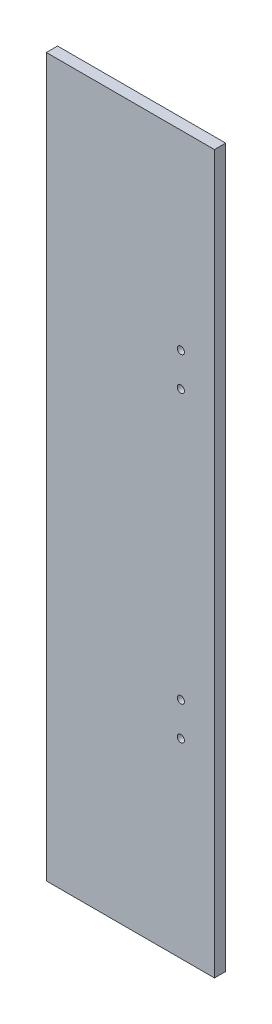
ISO-10303-21;
HEADER;
FILE_DESCRIPTION(('STEP AP214'),'2;1');
FILE_NAME('part.step','',(''),(''),'','','');
FILE_SCHEMA(('AUTOMOTIVE_DESIGN { 1 0 10303 214 1 1 1 1 }'));
ENDSEC;
DATA;
#1=APPLICATION_CONTEXT('core data for automotive mechanical design processes');
#2=APPLICATION_PROTOCOL_DEFINITION('international standard','automotive_design',2000,#1);
#3=PRODUCT_CONTEXT('',#1,'mechanical');
#4=PRODUCT('Part','Part','',(#3));
#5=PRODUCT_RELATED_PRODUCT_CATEGORY('part','',(#4));
#6=PRODUCT_DEFINITION_FORMATION('','',#4);
#7=PRODUCT_DEFINITION_CONTEXT('part definition',#1,'design');
#8=PRODUCT_DEFINITION('design','',#6,#7);
#9=PRODUCT_DEFINITION_SHAPE('','',#8);
#10=(LENGTH_UNIT() NAMED_UNIT(*) SI_UNIT(.MILLI.,.METRE.));
#11=(NAMED_UNIT(*) PLANE_ANGLE_UNIT() SI_UNIT($,.RADIAN.));
#12=(NAMED_UNIT(*) SI_UNIT($,.STERADIAN.) SOLID_ANGLE_UNIT());
#13=UNCERTAINTY_MEASURE_WITH_UNIT(LENGTH_MEASURE(1.E-05),#10,'distance_accuracy_value','');
#14=(GEOMETRIC_REPRESENTATION_CONTEXT(3) GLOBAL_UNCERTAINTY_ASSIGNED_CONTEXT((#13)) GLOBAL_UNIT_ASSIGNED_CONTEXT((#10,
#11,#12)) REPRESENTATION_CONTEXT('',''));
#15=CARTESIAN_POINT('',(0.,0.,0.));
#16=DIRECTION('',(0.,0.,1.));
#17=DIRECTION('',(1.,0.,0.));
#18=AXIS2_PLACEMENT_3D('',#15,#16,#17);
#19=CARTESIAN_POINT('',(37.5,-160.,5.));
#20=DIRECTION('',(-1.,0.,0.));
#21=DIRECTION('',(0.,0.,1.));
#22=AXIS2_PLACEMENT_3D('',#19,#20,#21);
#23=PLANE('',#22);
#24=DIRECTION('',(0.,1.,0.));
#25=VECTOR('',#24,1.);
#26=CARTESIAN_POINT('',(37.5,-160.,0.));
#27=LINE('',#26,#25);
#28=CARTESIAN_POINT('',(37.5,-160.,0.));
#29=VERTEX_POINT('',#28);
#30=CARTESIAN_POINT('',(37.5,160.,0.));
#31=VERTEX_POINT('',#30);
#32=EDGE_CURVE('E95',#29,#31,#27,.T.);
#33=ORIENTED_EDGE('',*,*,#32,.T.);
#34=DIRECTION('',(0.,0.,-1.));
#35=VECTOR('',#34,1.);
#36=CARTESIAN_POINT('',(37.5,160.,5.));
#37=LINE('',#36,#35);
#38=CARTESIAN_POINT('',(37.5,160.,5.));
#39=VERTEX_POINT('',#38);
#40=EDGE_CURVE('E11',#39,#31,#37,.T.);
#41=ORIENTED_EDGE('',*,*,#40,.F.);
#42=DIRECTION('',(0.,1.,0.));
#43=VECTOR('',#42,1.);
#44=CARTESIAN_POINT('',(37.5,-160.,5.));
#45=LINE('',#44,#43);
#46=CARTESIAN_POINT('',(37.5,-160.,5.));
#47=VERTEX_POINT('',#46);
#48=EDGE_CURVE('E83',#47,#39,#45,.T.);
#49=ORIENTED_EDGE('',*,*,#48,.F.);
#50=DIRECTION('',(0.,0.,-1.));
#51=VECTOR('',#50,1.);
#52=CARTESIAN_POINT('',(37.5,-160.,5.));
#53=LINE('',#52,#51);
#54=EDGE_CURVE('E91',#47,#29,#53,.T.);
#55=ORIENTED_EDGE('',*,*,#54,.T.);
#56=EDGE_LOOP('',(#33,#41,#49,#55));
#57=FACE_BOUND('',#56,.T.);
#58=ADVANCED_FACE('F32',(#57),#23,.F.);
#59=CARTESIAN_POINT('',(-37.5,160.,5.));
#60=DIRECTION('',(0.,-1.,0.));
#61=DIRECTION('',(0.,0.,-1.));
#62=AXIS2_PLACEMENT_3D('',#59,#60,#61);
#63=PLANE('',#62);
#64=DIRECTION('',(-1.,0.,0.));
#65=VECTOR('',#64,1.);
#66=CARTESIAN_POINT('',(-37.5,160.,0.));
#67=LINE('',#66,#65);
#68=CARTESIAN_POINT('',(-37.5,160.,0.));
#69=VERTEX_POINT('',#68);
#70=EDGE_CURVE('E87',#31,#69,#67,.T.);
#71=ORIENTED_EDGE('',*,*,#70,.T.);
#72=DIRECTION('',(0.,0.,-1.));
#73=VECTOR('',#72,1.);
#74=CARTESIAN_POINT('',(-37.5,160.,5.));
#75=LINE('',#74,#73);
#76=CARTESIAN_POINT('',(-37.5,160.,5.));
#77=VERTEX_POINT('',#76);
#78=EDGE_CURVE('E40',#77,#69,#75,.T.);
#79=ORIENTED_EDGE('',*,*,#78,.F.);
#80=DIRECTION('',(-1.,0.,0.));
#81=VECTOR('',#80,1.);
#82=CARTESIAN_POINT('',(-37.5,160.,5.));
#83=LINE('',#82,#81);
#84=EDGE_CURVE('E78',#39,#77,#83,.T.);
#85=ORIENTED_EDGE('',*,*,#84,.F.);
#86=ORIENTED_EDGE('',*,*,#40,.T.);
#87=EDGE_LOOP('',(#71,#79,#85,#86));
#88=FACE_BOUND('',#87,.T.);
#89=ADVANCED_FACE('F86',(#88),#63,.F.);
#90=CARTESIAN_POINT('',(-37.5,-160.,5.));
#91=DIRECTION('',(1.,0.,0.));
#92=DIRECTION('',(0.,0.,-1.));
#93=AXIS2_PLACEMENT_3D('',#90,#91,#92);
#94=PLANE('',#93);
#95=DIRECTION('',(0.,-1.,0.));
#96=VECTOR('',#95,1.);
#97=CARTESIAN_POINT('',(-37.5,-160.,0.));
#98=LINE('',#97,#96);
#99=CARTESIAN_POINT('',(-37.5,-160.,0.));
#100=VERTEX_POINT('',#99);
#101=EDGE_CURVE('E65',#69,#100,#98,.T.);
#102=ORIENTED_EDGE('',*,*,#101,.T.);
#103=DIRECTION('',(0.,0.,-1.));
#104=VECTOR('',#103,1.);
#105=CARTESIAN_POINT('',(-37.5,-160.,5.));
#106=LINE('',#105,#104);
#107=CARTESIAN_POINT('',(-37.5,-160.,5.));
#108=VERTEX_POINT('',#107);
#109=EDGE_CURVE('E88',#108,#100,#106,.T.);
#110=ORIENTED_EDGE('',*,*,#109,.F.);
#111=DIRECTION('',(0.,-1.,0.));
#112=VECTOR('',#111,1.);
#113=CARTESIAN_POINT('',(-37.5,-160.,5.));
#114=LINE('',#113,#112);
#115=EDGE_CURVE('E81',#77,#108,#114,.T.);
#116=ORIENTED_EDGE('',*,*,#115,.F.);
#117=ORIENTED_EDGE('',*,*,#78,.T.);
#118=EDGE_LOOP('',(#102,#110,#116,#117));
#119=FACE_BOUND('',#118,.T.);
#120=ADVANCED_FACE('F89',(#119),#94,.F.);
#121=CARTESIAN_POINT('',(-37.5,-160.,5.));
#122=DIRECTION('',(0.,1.,0.));
#123=DIRECTION('',(0.,0.,1.));
#124=AXIS2_PLACEMENT_3D('',#121,#122,#123);
#125=PLANE('',#124);
#126=DIRECTION('',(1.,0.,0.));
#127=VECTOR('',#126,1.);
#128=CARTESIAN_POINT('',(-37.5,-160.,0.));
#129=LINE('',#128,#127);
#130=EDGE_CURVE('E71',#100,#29,#129,.T.);
#131=ORIENTED_EDGE('',*,*,#130,.T.);
#132=ORIENTED_EDGE('',*,*,#54,.F.);
#133=DIRECTION('',(1.,0.,0.));
#134=VECTOR('',#133,1.);
#135=CARTESIAN_POINT('',(-37.5,-160.,5.));
#136=LINE('',#135,#134);
#137=EDGE_CURVE('E48',#108,#47,#136,.T.);
#138=ORIENTED_EDGE('',*,*,#137,.F.);
#139=ORIENTED_EDGE('',*,*,#109,.T.);
#140=EDGE_LOOP('',(#131,#132,#138,#139));
#141=FACE_BOUND('',#140,.T.);
#142=ADVANCED_FACE('F103',(#141),#125,.F.);
#143=CARTESIAN_POINT('',(0.,0.,5.));
#144=DIRECTION('',(0.,0.,-1.));
#145=DIRECTION('',(-1.,0.,0.));
#146=AXIS2_PLACEMENT_3D('',#143,#144,#145);
#147=PLANE('',#146);
#148=CARTESIAN_POINT('',(22.5,75.,5.));
#149=DIRECTION('',(0.,0.,-1.));
#150=DIRECTION('',(-1.,0.,0.));
#151=AXIS2_PLACEMENT_3D('',#148,#149,#150);
#152=CIRCLE('',#151,1.6);
#153=CARTESIAN_POINT('',(20.9,75.,5.));
#154=VERTEX_POINT('',#153);
#155=EDGE_CURVE('E98',#154,#154,#152,.F.);
#156=ORIENTED_EDGE('',*,*,#155,.F.);
#157=EDGE_LOOP('',(#156));
#158=FACE_BOUND('',#157,.T.);
#159=CARTESIAN_POINT('',(22.5,60.,5.));
#160=DIRECTION('',(0.,0.,-1.));
#161=DIRECTION('',(-1.,0.,0.));
#162=AXIS2_PLACEMENT_3D('',#159,#160,#161);
#163=CIRCLE('',#162,1.6);
#164=CARTESIAN_POINT('',(20.9,60.,5.));
#165=VERTEX_POINT('',#164);
#166=EDGE_CURVE('E122',#165,#165,#163,.F.);
#167=ORIENTED_EDGE('',*,*,#166,.F.);
#168=EDGE_LOOP('',(#167));
#169=FACE_BOUND('',#168,.T.);
#170=CARTESIAN_POINT('',(22.5,-60.,5.));
#171=DIRECTION('',(0.,0.,-1.));
#172=DIRECTION('',(-1.,0.,0.));
#173=AXIS2_PLACEMENT_3D('',#170,#171,#172);
#174=CIRCLE('',#173,1.6);
#175=CARTESIAN_POINT('',(20.9,-60.,5.));
#176=VERTEX_POINT('',#175);
#177=EDGE_CURVE('E116',#176,#176,#174,.F.);
#178=ORIENTED_EDGE('',*,*,#177,.F.);
#179=EDGE_LOOP('',(#178));
#180=FACE_BOUND('',#179,.T.);
#181=CARTESIAN_POINT('',(22.5,-75.,5.));
#182=DIRECTION('',(0.,0.,-1.));
#183=DIRECTION('',(-1.,0.,0.));
#184=AXIS2_PLACEMENT_3D('',#181,#182,#183);
#185=CIRCLE('',#184,1.6);
#186=CARTESIAN_POINT('',(20.9,-75.,5.));
#187=VERTEX_POINT('',#186);
#188=EDGE_CURVE('E109',#187,#187,#185,.F.);
#189=ORIENTED_EDGE('',*,*,#188,.F.);
#190=EDGE_LOOP('',(#189));
#191=FACE_BOUND('',#190,.T.);
#192=ORIENTED_EDGE('',*,*,#48,.T.);
#193=ORIENTED_EDGE('',*,*,#84,.T.);
#194=ORIENTED_EDGE('',*,*,#115,.T.);
#195=ORIENTED_EDGE('',*,*,#137,.T.);
#196=EDGE_LOOP('',(#192,#193,#194,#195));
#197=FACE_BOUND('',#196,.T.);
#198=ADVANCED_FACE('F79',(#158,#169,#180,#191,#197),#147,.F.);
#199=CARTESIAN_POINT('',(0.,0.,0.));
#200=DIRECTION('',(0.,0.,-1.));
#201=DIRECTION('',(-1.,0.,0.));
#202=AXIS2_PLACEMENT_3D('',#199,#200,#201);
#203=PLANE('',#202);
#204=CARTESIAN_POINT('',(22.5,75.,0.));
#205=DIRECTION('',(0.,0.,-1.));
#206=DIRECTION('',(-1.,0.,0.));
#207=AXIS2_PLACEMENT_3D('',#204,#205,#206);
#208=CIRCLE('',#207,1.6);
#209=CARTESIAN_POINT('',(20.9,75.,0.));
#210=VERTEX_POINT('',#209);
#211=EDGE_CURVE('E125',#210,#210,#208,.T.);
#212=ORIENTED_EDGE('',*,*,#211,.F.);
#213=EDGE_LOOP('',(#212));
#214=FACE_BOUND('',#213,.T.);
#215=CARTESIAN_POINT('',(22.5,60.,0.));
#216=DIRECTION('',(0.,0.,-1.));
#217=DIRECTION('',(-1.,0.,0.));
#218=AXIS2_PLACEMENT_3D('',#215,#216,#217);
#219=CIRCLE('',#218,1.6);
#220=CARTESIAN_POINT('',(20.9,60.,0.));
#221=VERTEX_POINT('',#220);
#222=EDGE_CURVE('E119',#221,#221,#219,.T.);
#223=ORIENTED_EDGE('',*,*,#222,.F.);
#224=EDGE_LOOP('',(#223));
#225=FACE_BOUND('',#224,.T.);
#226=CARTESIAN_POINT('',(22.5,-60.,0.));
#227=DIRECTION('',(0.,0.,-1.));
#228=DIRECTION('',(1.,0.,0.));
#229=AXIS2_PLACEMENT_3D('',#226,#227,#228);
#230=CIRCLE('',#229,1.6);
#231=CARTESIAN_POINT('',(24.1,-60.,0.));
#232=VERTEX_POINT('',#231);
#233=EDGE_CURVE('E112',#232,#232,#230,.T.);
#234=ORIENTED_EDGE('',*,*,#233,.F.);
#235=EDGE_LOOP('',(#234));
#236=FACE_BOUND('',#235,.T.);
#237=CARTESIAN_POINT('',(22.5,-75.,0.));
#238=DIRECTION('',(0.,0.,-1.));
#239=DIRECTION('',(1.,0.,0.));
#240=AXIS2_PLACEMENT_3D('',#237,#238,#239);
#241=CIRCLE('',#240,1.6);
#242=CARTESIAN_POINT('',(24.1,-75.,0.));
#243=VERTEX_POINT('',#242);
#244=EDGE_CURVE('E113',#243,#243,#241,.T.);
#245=ORIENTED_EDGE('',*,*,#244,.F.);
#246=EDGE_LOOP('',(#245));
#247=FACE_BOUND('',#246,.T.);
#248=ORIENTED_EDGE('',*,*,#32,.F.);
#249=ORIENTED_EDGE('',*,*,#130,.F.);
#250=ORIENTED_EDGE('',*,*,#101,.F.);
#251=ORIENTED_EDGE('',*,*,#70,.F.);
#252=EDGE_LOOP('',(#248,#249,#250,#251));
#253=FACE_BOUND('',#252,.T.);
#254=ADVANCED_FACE('F106',(#214,#225,#236,#247,#253),#203,.T.);
#255=CARTESIAN_POINT('',(22.5,-75.,5.001));
#256=DIRECTION('',(0.,0.,-1.));
#257=DIRECTION('',(-1.,0.,0.));
#258=AXIS2_PLACEMENT_3D('',#255,#256,#257);
#259=CYLINDRICAL_SURFACE('',#258,1.6);
#260=ORIENTED_EDGE('',*,*,#244,.T.);
#261=EDGE_LOOP('',(#260));
#262=FACE_BOUND('',#261,.T.);
#263=ORIENTED_EDGE('',*,*,#188,.T.);
#264=EDGE_LOOP('',(#263));
#265=FACE_BOUND('',#264,.T.);
#266=ADVANCED_FACE('F138',(#262,#265),#259,.F.);
#267=CARTESIAN_POINT('',(22.5,-60.,5.001));
#268=DIRECTION('',(0.,0.,-1.));
#269=DIRECTION('',(-1.,0.,0.));
#270=AXIS2_PLACEMENT_3D('',#267,#268,#269);
#271=CYLINDRICAL_SURFACE('',#270,1.6);
#272=ORIENTED_EDGE('',*,*,#233,.T.);
#273=EDGE_LOOP('',(#272));
#274=FACE_BOUND('',#273,.T.);
#275=ORIENTED_EDGE('',*,*,#177,.T.);
#276=EDGE_LOOP('',(#275));
#277=FACE_BOUND('',#276,.T.);
#278=ADVANCED_FACE('F148',(#274,#277),#271,.F.);
#279=CARTESIAN_POINT('',(22.5,60.,5.001));
#280=DIRECTION('',(0.,0.,-1.));
#281=DIRECTION('',(-1.,0.,0.));
#282=AXIS2_PLACEMENT_3D('',#279,#280,#281);
#283=CYLINDRICAL_SURFACE('',#282,1.6);
#284=ORIENTED_EDGE('',*,*,#222,.T.);
#285=EDGE_LOOP('',(#284));
#286=FACE_BOUND('',#285,.T.);
#287=ORIENTED_EDGE('',*,*,#166,.T.);
#288=EDGE_LOOP('',(#287));
#289=FACE_BOUND('',#288,.T.);
#290=ADVANCED_FACE('F200',(#286,#289),#283,.F.);
#291=CARTESIAN_POINT('',(22.5,75.,5.001));
#292=DIRECTION('',(0.,0.,-1.));
#293=DIRECTION('',(-1.,0.,0.));
#294=AXIS2_PLACEMENT_3D('',#291,#292,#293);
#295=CYLINDRICAL_SURFACE('',#294,1.6);
#296=ORIENTED_EDGE('',*,*,#211,.T.);
#297=EDGE_LOOP('',(#296));
#298=FACE_BOUND('',#297,.T.);
#299=ORIENTED_EDGE('',*,*,#155,.T.);
#300=EDGE_LOOP('',(#299));
#301=FACE_BOUND('',#300,.T.);
#302=ADVANCED_FACE('F133',(#298,#301),#295,.F.);
#303=CLOSED_SHELL('',(#58,#89,#120,#142,#198,#254,#266,#278,#290,#302));
#304=MANIFOLD_SOLID_BREP('B2',#303);
#305=ADVANCED_BREP_SHAPE_REPRESENTATION('',(#18,#304),#14);
#306=SHAPE_DEFINITION_REPRESENTATION(#9,#305);
ENDSEC;
END-ISO-10303-21;
